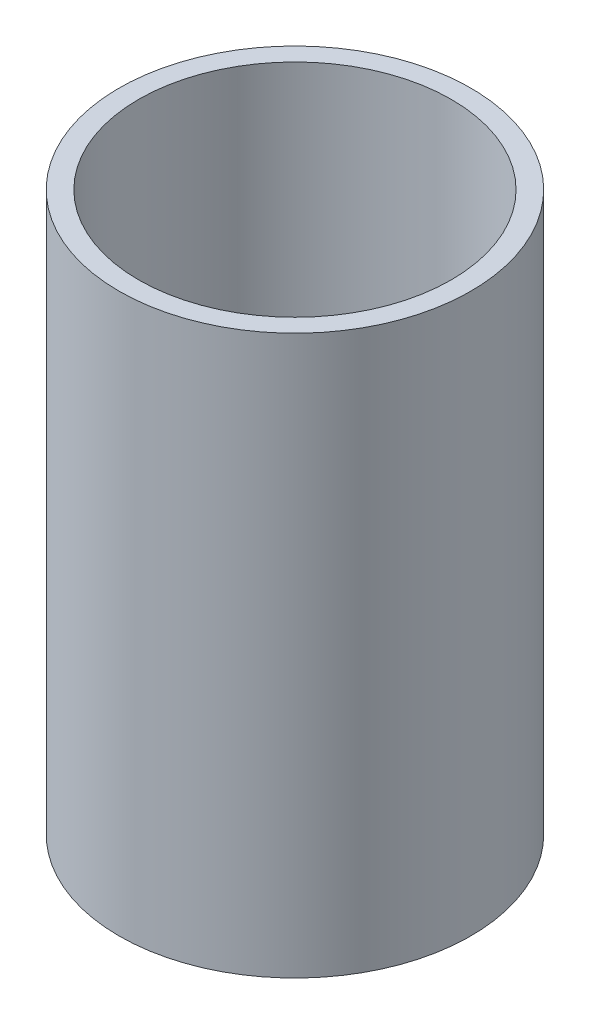
ISO-10303-21;
HEADER;
FILE_DESCRIPTION(('STEP AP214'),'2;1');
FILE_NAME('part.step','',(''),(''),'','','');
FILE_SCHEMA(('AUTOMOTIVE_DESIGN { 1 0 10303 214 1 1 1 1 }'));
ENDSEC;
DATA;
#1=APPLICATION_CONTEXT('core data for automotive mechanical design processes');
#2=APPLICATION_PROTOCOL_DEFINITION('international standard','automotive_design',2000,#1);
#3=PRODUCT_CONTEXT('',#1,'mechanical');
#4=PRODUCT('Part','Part','',(#3));
#5=PRODUCT_RELATED_PRODUCT_CATEGORY('part','',(#4));
#6=PRODUCT_DEFINITION_FORMATION('','',#4);
#7=PRODUCT_DEFINITION_CONTEXT('part definition',#1,'design');
#8=PRODUCT_DEFINITION('design','',#6,#7);
#9=PRODUCT_DEFINITION_SHAPE('','',#8);
#10=(LENGTH_UNIT() NAMED_UNIT(*) SI_UNIT(.MILLI.,.METRE.));
#11=(NAMED_UNIT(*) PLANE_ANGLE_UNIT() SI_UNIT($,.RADIAN.));
#12=(NAMED_UNIT(*) SI_UNIT($,.STERADIAN.) SOLID_ANGLE_UNIT());
#13=UNCERTAINTY_MEASURE_WITH_UNIT(LENGTH_MEASURE(1.E-05),#10,'distance_accuracy_value','');
#14=(GEOMETRIC_REPRESENTATION_CONTEXT(3) GLOBAL_UNCERTAINTY_ASSIGNED_CONTEXT((#13)) GLOBAL_UNIT_ASSIGNED_CONTEXT((#10,
#11,#12)) REPRESENTATION_CONTEXT('',''));
#15=CARTESIAN_POINT('',(0.,0.,0.));
#16=DIRECTION('',(0.,0.,1.));
#17=DIRECTION('',(1.,0.,0.));
#18=AXIS2_PLACEMENT_3D('',#15,#16,#17);
#19=CARTESIAN_POINT('',(0.,100.,0.));
#20=DIRECTION('',(0.,1.,0.));
#21=DIRECTION('',(0.,0.,1.));
#22=AXIS2_PLACEMENT_3D('',#19,#20,#21);
#23=PLANE('',#22);
#24=CARTESIAN_POINT('',(0.,100.,0.));
#25=DIRECTION('',(0.,1.,0.));
#26=DIRECTION('',(0.,0.,1.));
#27=AXIS2_PLACEMENT_3D('',#24,#25,#26);
#28=CIRCLE('',#27,31.5);
#29=CARTESIAN_POINT('',(0.,100.,31.5));
#30=VERTEX_POINT('',#29);
#31=EDGE_CURVE('E10',#30,#30,#28,.T.);
#32=ORIENTED_EDGE('',*,*,#31,.T.);
#33=EDGE_LOOP('',(#32));
#34=FACE_BOUND('',#33,.T.);
#35=CARTESIAN_POINT('',(0.,100.,0.));
#36=DIRECTION('',(0.,1.,0.));
#37=DIRECTION('',(0.,0.,1.));
#38=AXIS2_PLACEMENT_3D('',#35,#36,#37);
#39=CIRCLE('',#38,28.);
#40=CARTESIAN_POINT('',(0.,100.,28.));
#41=VERTEX_POINT('',#40);
#42=EDGE_CURVE('E39',#41,#41,#39,.T.);
#43=ORIENTED_EDGE('',*,*,#42,.F.);
#44=EDGE_LOOP('',(#43));
#45=FACE_BOUND('',#44,.T.);
#46=ADVANCED_FACE('F28',(#34,#45),#23,.T.);
#47=CARTESIAN_POINT('',(0.,0.,0.));
#48=DIRECTION('',(0.,1.,0.));
#49=DIRECTION('',(0.,0.,1.));
#50=AXIS2_PLACEMENT_3D('',#47,#48,#49);
#51=PLANE('',#50);
#52=CARTESIAN_POINT('',(0.,0.,0.));
#53=DIRECTION('',(0.,1.,0.));
#54=DIRECTION('',(0.,0.,1.));
#55=AXIS2_PLACEMENT_3D('',#52,#53,#54);
#56=CIRCLE('',#55,31.5);
#57=CARTESIAN_POINT('',(0.,0.,31.5));
#58=VERTEX_POINT('',#57);
#59=EDGE_CURVE('E32',#58,#58,#56,.T.);
#60=ORIENTED_EDGE('',*,*,#59,.F.);
#61=EDGE_LOOP('',(#60));
#62=FACE_BOUND('',#61,.T.);
#63=CARTESIAN_POINT('',(0.,0.,0.));
#64=DIRECTION('',(0.,1.,0.));
#65=DIRECTION('',(0.,0.,1.));
#66=AXIS2_PLACEMENT_3D('',#63,#64,#65);
#67=CIRCLE('',#66,28.);
#68=CARTESIAN_POINT('',(0.,0.,28.));
#69=VERTEX_POINT('',#68);
#70=EDGE_CURVE('E41',#69,#69,#67,.T.);
#71=ORIENTED_EDGE('',*,*,#70,.T.);
#72=EDGE_LOOP('',(#71));
#73=FACE_BOUND('',#72,.T.);
#74=ADVANCED_FACE('F51',(#62,#73),#51,.F.);
#75=CARTESIAN_POINT('',(0.,100.,0.));
#76=DIRECTION('',(0.,-1.,0.));
#77=DIRECTION('',(0.,0.,-1.));
#78=AXIS2_PLACEMENT_3D('',#75,#76,#77);
#79=CYLINDRICAL_SURFACE('',#78,31.5);
#80=ORIENTED_EDGE('',*,*,#31,.F.);
#81=EDGE_LOOP('',(#80));
#82=FACE_BOUND('',#81,.T.);
#83=ORIENTED_EDGE('',*,*,#59,.T.);
#84=EDGE_LOOP('',(#83));
#85=FACE_BOUND('',#84,.T.);
#86=ADVANCED_FACE('F30',(#82,#85),#79,.T.);
#87=CARTESIAN_POINT('',(0.,100.,0.));
#88=DIRECTION('',(0.,-1.,0.));
#89=DIRECTION('',(0.,0.,-1.));
#90=AXIS2_PLACEMENT_3D('',#87,#88,#89);
#91=CYLINDRICAL_SURFACE('',#90,28.);
#92=ORIENTED_EDGE('',*,*,#42,.T.);
#93=EDGE_LOOP('',(#92));
#94=FACE_BOUND('',#93,.T.);
#95=ORIENTED_EDGE('',*,*,#70,.F.);
#96=EDGE_LOOP('',(#95));
#97=FACE_BOUND('',#96,.T.);
#98=ADVANCED_FACE('F47',(#94,#97),#91,.F.);
#99=CLOSED_SHELL('',(#46,#74,#86,#98));
#100=MANIFOLD_SOLID_BREP('B2',#99);
#101=ADVANCED_BREP_SHAPE_REPRESENTATION('',(#18,#100),#14);
#102=SHAPE_DEFINITION_REPRESENTATION(#9,#101);
ENDSEC;
END-ISO-10303-21;
